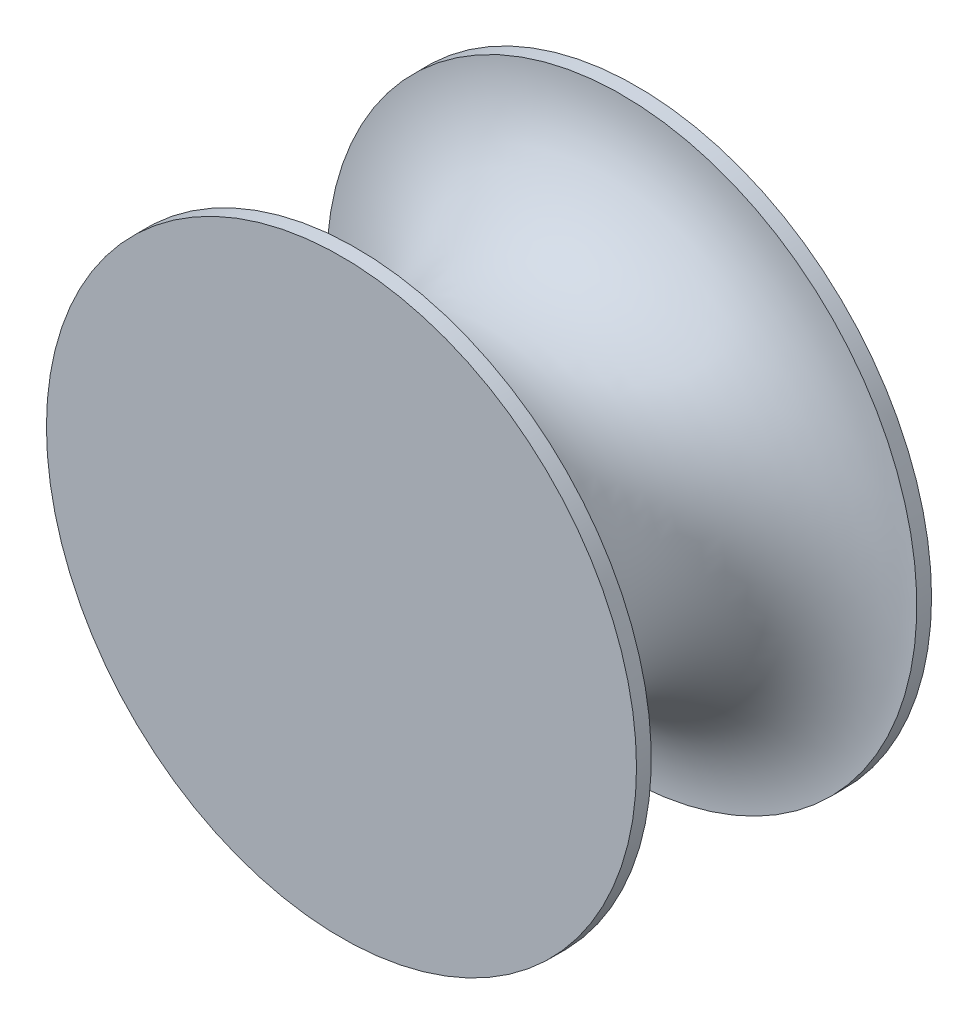
ISO-10303-21;
HEADER;
FILE_DESCRIPTION(('STEP AP214'),'2;1');
FILE_NAME('part.step','',(''),(''),'','','');
FILE_SCHEMA(('AUTOMOTIVE_DESIGN { 1 0 10303 214 1 1 1 1 }'));
ENDSEC;
DATA;
#1=APPLICATION_CONTEXT('core data for automotive mechanical design processes');
#2=APPLICATION_PROTOCOL_DEFINITION('international standard','automotive_design',2000,#1);
#3=PRODUCT_CONTEXT('',#1,'mechanical');
#4=PRODUCT('Part','Part','',(#3));
#5=PRODUCT_RELATED_PRODUCT_CATEGORY('part','',(#4));
#6=PRODUCT_DEFINITION_FORMATION('','',#4);
#7=PRODUCT_DEFINITION_CONTEXT('part definition',#1,'design');
#8=PRODUCT_DEFINITION('design','',#6,#7);
#9=PRODUCT_DEFINITION_SHAPE('','',#8);
#10=(LENGTH_UNIT() NAMED_UNIT(*) SI_UNIT(.MILLI.,.METRE.));
#11=(NAMED_UNIT(*) PLANE_ANGLE_UNIT() SI_UNIT($,.RADIAN.));
#12=(NAMED_UNIT(*) SI_UNIT($,.STERADIAN.) SOLID_ANGLE_UNIT());
#13=UNCERTAINTY_MEASURE_WITH_UNIT(LENGTH_MEASURE(1.E-05),#10,'distance_accuracy_value','');
#14=(GEOMETRIC_REPRESENTATION_CONTEXT(3) GLOBAL_UNCERTAINTY_ASSIGNED_CONTEXT((#13)) GLOBAL_UNIT_ASSIGNED_CONTEXT((#10,
#11,#12)) REPRESENTATION_CONTEXT('',''));
#15=CARTESIAN_POINT('',(0.,0.,0.));
#16=DIRECTION('',(0.,0.,1.));
#17=DIRECTION('',(1.,0.,0.));
#18=AXIS2_PLACEMENT_3D('',#15,#16,#17);
#19=CARTESIAN_POINT('',(0.,0.,12.7));
#20=DIRECTION('',(0.,0.,-1.));
#21=DIRECTION('',(-1.,0.,0.));
#22=AXIS2_PLACEMENT_3D('',#19,#20,#21);
#23=CYLINDRICAL_SURFACE('',#22,12.7);
#24=CARTESIAN_POINT('',(0.,0.,0.635));
#25=DIRECTION('',(0.,0.,-1.));
#26=DIRECTION('',(-1.,0.,0.));
#27=AXIS2_PLACEMENT_3D('',#24,#25,#26);
#28=CIRCLE('',#27,12.7);
#29=CARTESIAN_POINT('',(-12.7,0.,0.635));
#30=VERTEX_POINT('',#29);
#31=EDGE_CURVE('E59',#30,#30,#28,.T.);
#32=ORIENTED_EDGE('',*,*,#31,.T.);
#33=EDGE_LOOP('',(#32));
#34=FACE_BOUND('',#33,.T.);
#35=CARTESIAN_POINT('',(0.,0.,0.));
#36=DIRECTION('',(0.,0.,1.));
#37=DIRECTION('',(1.,0.,0.));
#38=AXIS2_PLACEMENT_3D('',#35,#36,#37);
#39=CIRCLE('',#38,12.7);
#40=CARTESIAN_POINT('',(12.7,0.,0.));
#41=VERTEX_POINT('',#40);
#42=EDGE_CURVE('E41',#41,#41,#39,.T.);
#43=ORIENTED_EDGE('',*,*,#42,.T.);
#44=EDGE_LOOP('',(#43));
#45=FACE_BOUND('',#44,.T.);
#46=ADVANCED_FACE('F37',(#34,#45),#23,.T.);
#47=CARTESIAN_POINT('',(0.,0.,0.));
#48=DIRECTION('',(0.,0.,1.));
#49=DIRECTION('',(1.,0.,0.));
#50=AXIS2_PLACEMENT_3D('',#47,#48,#49);
#51=PLANE('',#50);
#52=CARTESIAN_POINT('',(0.,0.,0.));
#53=DIRECTION('',(0.,0.,-1.));
#54=DIRECTION('',(-1.,0.,0.));
#55=AXIS2_PLACEMENT_3D('',#52,#53,#54);
#56=CIRCLE('',#55,7.62);
#57=CARTESIAN_POINT('',(-7.62,0.,0.));
#58=VERTEX_POINT('',#57);
#59=EDGE_CURVE('E10',#58,#58,#56,.T.);
#60=ORIENTED_EDGE('',*,*,#59,.F.);
#61=EDGE_LOOP('',(#60));
#62=FACE_BOUND('',#61,.T.);
#63=ORIENTED_EDGE('',*,*,#42,.F.);
#64=EDGE_LOOP('',(#63));
#65=FACE_BOUND('',#64,.T.);
#66=ADVANCED_FACE('F69',(#62,#65),#51,.F.);
#67=CARTESIAN_POINT('',(0.,0.,6.35));
#68=DIRECTION('',(0.,0.,-1.));
#69=DIRECTION('',(-1.,0.,0.));
#70=AXIS2_PLACEMENT_3D('',#67,#68,#69);
#71=TOROIDAL_SURFACE('',#70,12.7,5.715);
#72=ORIENTED_EDGE('',*,*,#31,.F.);
#73=EDGE_LOOP('',(#72));
#74=FACE_BOUND('',#73,.T.);
#75=CARTESIAN_POINT('',(0.,0.,12.065));
#76=DIRECTION('',(0.,0.,-1.));
#77=DIRECTION('',(-1.,0.,0.));
#78=AXIS2_PLACEMENT_3D('',#75,#76,#77);
#79=CIRCLE('',#78,12.7);
#80=CARTESIAN_POINT('',(-12.7,0.,12.065));
#81=VERTEX_POINT('',#80);
#82=EDGE_CURVE('E55',#81,#81,#79,.T.);
#83=ORIENTED_EDGE('',*,*,#82,.T.);
#84=EDGE_LOOP('',(#83));
#85=FACE_BOUND('',#84,.T.);
#86=ADVANCED_FACE('F71',(#74,#85),#71,.F.);
#87=CARTESIAN_POINT('',(0.,0.,12.7));
#88=DIRECTION('',(0.,0.,1.));
#89=DIRECTION('',(1.,0.,0.));
#90=AXIS2_PLACEMENT_3D('',#87,#88,#89);
#91=PLANE('',#90);
#92=CARTESIAN_POINT('',(0.,0.,12.7));
#93=DIRECTION('',(0.,0.,1.));
#94=DIRECTION('',(1.,0.,0.));
#95=AXIS2_PLACEMENT_3D('',#92,#93,#94);
#96=CIRCLE('',#95,12.7);
#97=CARTESIAN_POINT('',(12.7,0.,12.7));
#98=VERTEX_POINT('',#97);
#99=EDGE_CURVE('E46',#98,#98,#96,.T.);
#100=ORIENTED_EDGE('',*,*,#99,.T.);
#101=EDGE_LOOP('',(#100));
#102=FACE_BOUND('',#101,.T.);
#103=ADVANCED_FACE('F77',(#102),#91,.T.);
#104=ORIENTED_EDGE('',*,*,#82,.F.);
#105=EDGE_LOOP('',(#104));
#106=FACE_BOUND('',#105,.T.);
#107=ORIENTED_EDGE('',*,*,#99,.F.);
#108=EDGE_LOOP('',(#107));
#109=FACE_BOUND('',#108,.T.);
#110=ADVANCED_FACE('F39',(#106,#109),#23,.T.);
#111=CARTESIAN_POINT('',(0.,0.,-2.54));
#112=DIRECTION('',(0.,0.,1.));
#113=DIRECTION('',(1.,0.,0.));
#114=AXIS2_PLACEMENT_3D('',#111,#112,#113);
#115=CYLINDRICAL_SURFACE('',#114,7.62);
#116=CARTESIAN_POINT('',(0.,0.,-2.54));
#117=DIRECTION('',(0.,0.,-1.));
#118=DIRECTION('',(-1.,0.,0.));
#119=AXIS2_PLACEMENT_3D('',#116,#117,#118);
#120=CIRCLE('',#119,7.62);
#121=CARTESIAN_POINT('',(-7.62,0.,-2.54));
#122=VERTEX_POINT('',#121);
#123=EDGE_CURVE('E54',#122,#122,#120,.T.);
#124=ORIENTED_EDGE('',*,*,#123,.F.);
#125=EDGE_LOOP('',(#124));
#126=FACE_BOUND('',#125,.T.);
#127=ORIENTED_EDGE('',*,*,#59,.T.);
#128=EDGE_LOOP('',(#127));
#129=FACE_BOUND('',#128,.T.);
#130=ADVANCED_FACE('F84',(#126,#129),#115,.T.);
#131=CARTESIAN_POINT('',(0.,0.,-2.54));
#132=DIRECTION('',(0.,0.,-1.));
#133=DIRECTION('',(-1.,0.,0.));
#134=AXIS2_PLACEMENT_3D('',#131,#132,#133);
#135=PLANE('',#134);
#136=ORIENTED_EDGE('',*,*,#123,.T.);
#137=EDGE_LOOP('',(#136));
#138=FACE_BOUND('',#137,.T.);
#139=ADVANCED_FACE('F87',(#138),#135,.T.);
#140=CLOSED_SHELL('',(#46,#66,#86,#103,#110,#130,#139));
#141=MANIFOLD_SOLID_BREP('B2',#140);
#142=ADVANCED_BREP_SHAPE_REPRESENTATION('',(#18,#141),#14);
#143=SHAPE_DEFINITION_REPRESENTATION(#9,#142);
ENDSEC;
END-ISO-10303-21;
